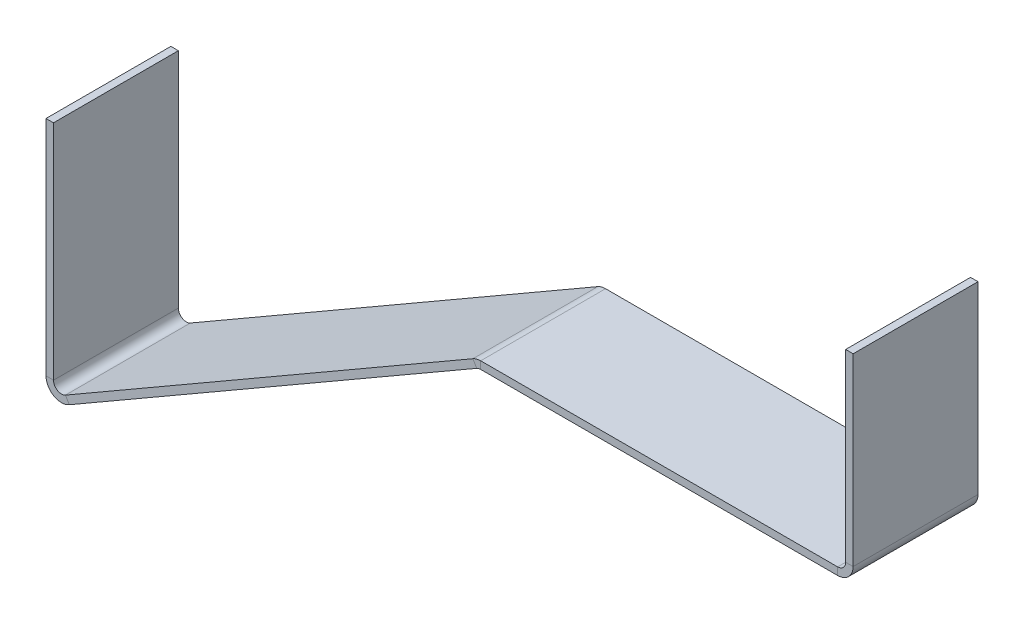
ISO-10303-21;
HEADER;
FILE_DESCRIPTION(('STEP AP214'),'2;1');
FILE_NAME('part.step','',(''),(''),'','','');
FILE_SCHEMA(('AUTOMOTIVE_DESIGN { 1 0 10303 214 1 1 1 1 }'));
ENDSEC;
DATA;
#1=APPLICATION_CONTEXT('core data for automotive mechanical design processes');
#2=APPLICATION_PROTOCOL_DEFINITION('international standard','automotive_design',2000,#1);
#3=PRODUCT_CONTEXT('',#1,'mechanical');
#4=PRODUCT('Part','Part','',(#3));
#5=PRODUCT_RELATED_PRODUCT_CATEGORY('part','',(#4));
#6=PRODUCT_DEFINITION_FORMATION('','',#4);
#7=PRODUCT_DEFINITION_CONTEXT('part definition',#1,'design');
#8=PRODUCT_DEFINITION('design','',#6,#7);
#9=PRODUCT_DEFINITION_SHAPE('','',#8);
#10=(LENGTH_UNIT() NAMED_UNIT(*) SI_UNIT(.MILLI.,.METRE.));
#11=(NAMED_UNIT(*) PLANE_ANGLE_UNIT() SI_UNIT($,.RADIAN.));
#12=(NAMED_UNIT(*) SI_UNIT($,.STERADIAN.) SOLID_ANGLE_UNIT());
#13=UNCERTAINTY_MEASURE_WITH_UNIT(LENGTH_MEASURE(1.E-05),#10,'distance_accuracy_value','');
#14=(GEOMETRIC_REPRESENTATION_CONTEXT(3) GLOBAL_UNCERTAINTY_ASSIGNED_CONTEXT((#13)) GLOBAL_UNIT_ASSIGNED_CONTEXT((#10,
#11,#12)) REPRESENTATION_CONTEXT('',''));
#15=CARTESIAN_POINT('',(0.,0.,0.));
#16=DIRECTION('',(0.,0.,1.));
#17=DIRECTION('',(1.,0.,0.));
#18=AXIS2_PLACEMENT_3D('',#15,#16,#17);
#19=CARTESIAN_POINT('',(-173.205080756888,-89.2612849930732,25.));
#20=DIRECTION('',(0.,0.,1.));
#21=DIRECTION('',(1.,0.,0.));
#22=AXIS2_PLACEMENT_3D('',#19,#20,#21);
#23=PLANE('',#22);
#24=DIRECTION('',(1.,0.,0.));
#25=VECTOR('',#24,1.);
#26=CARTESIAN_POINT('',(-173.205080756888,-89.2612849930732,25.));
#27=LINE('',#26,#25);
#28=CARTESIAN_POINT('',(-173.205080756888,-89.2612849930732,25.));
#29=VERTEX_POINT('',#28);
#30=CARTESIAN_POINT('',(-170.205080756888,-89.2612849930732,25.));
#31=VERTEX_POINT('',#30);
#32=EDGE_CURVE('E11',#29,#31,#27,.T.);
#33=ORIENTED_EDGE('',*,*,#32,.F.);
#34=CARTESIAN_POINT('',(-167.005080756888,-89.2612849930732,25.));
#35=DIRECTION('',(0.,0.,-1.));
#36=DIRECTION('',(-1.,0.,0.));
#37=AXIS2_PLACEMENT_3D('',#34,#35,#36);
#38=CIRCLE('',#37,6.2);
#39=CARTESIAN_POINT('',(-163.905080756888,-94.6306424965367,25.));
#40=VERTEX_POINT('',#39);
#41=EDGE_CURVE('E304',#29,#40,#38,.F.);
#42=ORIENTED_EDGE('',*,*,#41,.T.);
#43=DIRECTION('',(0.500000000000001,-0.866025403784438,0.));
#44=VECTOR('',#43,1.);
#45=CARTESIAN_POINT('',(-165.405080756888,-92.0325662851834,25.));
#46=LINE('',#45,#44);
#47=CARTESIAN_POINT('',(-165.405080756888,-92.0325662851834,25.));
#48=VERTEX_POINT('',#47);
#49=EDGE_CURVE('E45',#48,#40,#46,.T.);
#50=ORIENTED_EDGE('',*,*,#49,.F.);
#51=CARTESIAN_POINT('',(-167.005080756888,-89.2612849930732,25.));
#52=DIRECTION('',(0.,0.,1.));
#53=DIRECTION('',(1.,0.,0.));
#54=AXIS2_PLACEMENT_3D('',#51,#52,#53);
#55=CIRCLE('',#54,3.2);
#56=EDGE_CURVE('E323',#31,#48,#55,.T.);
#57=ORIENTED_EDGE('',*,*,#56,.F.);
#58=EDGE_LOOP('',(#33,#42,#50,#57));
#59=FACE_BOUND('',#58,.T.);
#60=ADVANCED_FACE('F37',(#59),#23,.T.);
#61=CARTESIAN_POINT('',(-165.405080756888,-92.0325662851834,25.));
#62=DIRECTION('',(0.,0.,1.));
#63=DIRECTION('',(1.,0.,0.));
#64=AXIS2_PLACEMENT_3D('',#61,#62,#63);
#65=PLANE('',#64);
#66=DIRECTION('',(0.,-1.,0.));
#67=VECTOR('',#66,1.);
#68=CARTESIAN_POINT('',(-173.205080756888,-2.77555756156289E-13,25.));
#69=LINE('',#68,#67);
#70=CARTESIAN_POINT('',(-173.205080756888,-2.77555756156289E-13,25.));
#71=VERTEX_POINT('',#70);
#72=EDGE_CURVE('E308',#71,#29,#69,.T.);
#73=ORIENTED_EDGE('',*,*,#72,.T.);
#74=ORIENTED_EDGE('',*,*,#32,.T.);
#75=DIRECTION('',(0.,1.,0.));
#76=VECTOR('',#75,1.);
#77=CARTESIAN_POINT('',(-170.205080756888,-2.77555756156289E-13,25.));
#78=LINE('',#77,#76);
#79=CARTESIAN_POINT('',(-170.205080756888,-2.77555756156289E-13,25.));
#80=VERTEX_POINT('',#79);
#81=EDGE_CURVE('E320',#80,#31,#78,.F.);
#82=ORIENTED_EDGE('',*,*,#81,.F.);
#83=DIRECTION('',(1.,0.,0.));
#84=VECTOR('',#83,1.);
#85=CARTESIAN_POINT('',(-173.205080756888,-2.77555756156289E-13,25.));
#86=LINE('',#85,#84);
#87=EDGE_CURVE('E317',#71,#80,#86,.T.);
#88=ORIENTED_EDGE('',*,*,#87,.F.);
#89=EDGE_LOOP('',(#73,#74,#82,#88));
#90=FACE_BOUND('',#89,.T.);
#91=ADVANCED_FACE('F373',(#90),#65,.T.);
#92=CARTESIAN_POINT('',(-163.905080756888,-94.6306424965367,-25.));
#93=DIRECTION('',(0.,0.,-1.));
#94=DIRECTION('',(-1.,0.,0.));
#95=AXIS2_PLACEMENT_3D('',#92,#93,#94);
#96=PLANE('',#95);
#97=DIRECTION('',(-0.500000000000001,0.866025403784438,0.));
#98=VECTOR('',#97,1.);
#99=CARTESIAN_POINT('',(-163.905080756888,-94.6306424965367,-25.));
#100=LINE('',#99,#98);
#101=CARTESIAN_POINT('',(-163.905080756888,-94.6306424965367,-25.));
#102=VERTEX_POINT('',#101);
#103=CARTESIAN_POINT('',(-165.405080756888,-92.0325662851834,-25.));
#104=VERTEX_POINT('',#103);
#105=EDGE_CURVE('E290',#102,#104,#100,.T.);
#106=ORIENTED_EDGE('',*,*,#105,.F.);
#107=CARTESIAN_POINT('',(-167.005080756888,-89.2612849930732,-25.));
#108=DIRECTION('',(0.,0.,-1.));
#109=DIRECTION('',(-1.,0.,0.));
#110=AXIS2_PLACEMENT_3D('',#107,#108,#109);
#111=CIRCLE('',#110,6.2);
#112=CARTESIAN_POINT('',(-173.205080756888,-89.2612849930732,-25.));
#113=VERTEX_POINT('',#112);
#114=EDGE_CURVE('E232',#113,#102,#111,.F.);
#115=ORIENTED_EDGE('',*,*,#114,.F.);
#116=DIRECTION('',(-1.,0.,0.));
#117=VECTOR('',#116,1.);
#118=CARTESIAN_POINT('',(-170.205080756888,-89.2612849930732,-25.));
#119=LINE('',#118,#117);
#120=CARTESIAN_POINT('',(-170.205080756888,-89.2612849930732,-25.));
#121=VERTEX_POINT('',#120);
#122=EDGE_CURVE('E288',#121,#113,#119,.T.);
#123=ORIENTED_EDGE('',*,*,#122,.F.);
#124=CARTESIAN_POINT('',(-167.005080756888,-89.2612849930732,-25.));
#125=DIRECTION('',(0.,0.,1.));
#126=DIRECTION('',(1.,0.,0.));
#127=AXIS2_PLACEMENT_3D('',#124,#125,#126);
#128=CIRCLE('',#127,3.2);
#129=EDGE_CURVE('E220',#121,#104,#128,.T.);
#130=ORIENTED_EDGE('',*,*,#129,.T.);
#131=EDGE_LOOP('',(#106,#115,#123,#130));
#132=FACE_BOUND('',#131,.T.);
#133=ADVANCED_FACE('F383',(#132),#96,.T.);
#134=CARTESIAN_POINT('',(-170.205080756888,-89.2612849930732,-25.));
#135=DIRECTION('',(0.,0.,-1.));
#136=DIRECTION('',(-1.,0.,0.));
#137=AXIS2_PLACEMENT_3D('',#134,#135,#136);
#138=PLANE('',#137);
#139=DIRECTION('',(0.866025403784438,0.500000000000001,0.));
#140=VECTOR('',#139,1.);
#141=CARTESIAN_POINT('',(-173.205080756888,-100.,-25.));
#142=LINE('',#141,#140);
#143=CARTESIAN_POINT('',(-0.742562584220147,-0.42871870788963,-25.));
#144=VERTEX_POINT('',#143);
#145=EDGE_CURVE('E235',#102,#144,#142,.T.);
#146=ORIENTED_EDGE('',*,*,#145,.F.);
#147=ORIENTED_EDGE('',*,*,#105,.T.);
#148=DIRECTION('',(0.866025403784438,0.500000000000001,0.));
#149=VECTOR('',#148,1.);
#150=CARTESIAN_POINT('',(-174.705080756888,-97.401923788647,-25.));
#151=LINE('',#150,#149);
#152=CARTESIAN_POINT('',(-2.24256258422004,2.16935750346367,-25.));
#153=VERTEX_POINT('',#152);
#154=EDGE_CURVE('E217',#104,#153,#151,.T.);
#155=ORIENTED_EDGE('',*,*,#154,.T.);
#156=DIRECTION('',(0.499999999999977,-0.866025403784452,0.));
#157=VECTOR('',#156,1.);
#158=CARTESIAN_POINT('',(-2.24256258422004,2.16935750346367,-25.));
#159=LINE('',#158,#157);
#160=EDGE_CURVE('E284',#153,#144,#159,.T.);
#161=ORIENTED_EDGE('',*,*,#160,.T.);
#162=EDGE_LOOP('',(#146,#147,#155,#161));
#163=FACE_BOUND('',#162,.T.);
#164=ADVANCED_FACE('F385',(#163),#138,.T.);
#165=CARTESIAN_POINT('',(-0.742562584220147,-0.42871870788963,25.));
#166=DIRECTION('',(0.,0.,1.));
#167=DIRECTION('',(1.,0.,0.));
#168=AXIS2_PLACEMENT_3D('',#165,#166,#167);
#169=PLANE('',#168);
#170=DIRECTION('',(-0.499999999999977,0.866025403784452,0.));
#171=VECTOR('',#170,1.);
#172=CARTESIAN_POINT('',(-0.742562584220147,-0.42871870788963,25.));
#173=LINE('',#172,#171);
#174=CARTESIAN_POINT('',(-0.742562584220147,-0.42871870788963,25.));
#175=VERTEX_POINT('',#174);
#176=CARTESIAN_POINT('',(-2.24256258422004,2.16935750346367,25.));
#177=VERTEX_POINT('',#176);
#178=EDGE_CURVE('E170',#175,#177,#173,.T.);
#179=ORIENTED_EDGE('',*,*,#178,.F.);
#180=CARTESIAN_POINT('',(0.857437415779813,-3.19999999999993,25.));
#181=DIRECTION('',(0.,0.,1.));
#182=DIRECTION('',(1.,0.,0.));
#183=AXIS2_PLACEMENT_3D('',#180,#181,#182);
#184=CIRCLE('',#183,3.2);
#185=CARTESIAN_POINT('',(0.857437415779813,0.,25.));
#186=VERTEX_POINT('',#185);
#187=EDGE_CURVE('E174',#175,#186,#184,.F.);
#188=ORIENTED_EDGE('',*,*,#187,.T.);
#189=DIRECTION('',(0.,-1.,0.));
#190=VECTOR('',#189,1.);
#191=CARTESIAN_POINT('',(0.857437415779813,3.,25.));
#192=LINE('',#191,#190);
#193=CARTESIAN_POINT('',(0.857437415779813,3.,25.));
#194=VERTEX_POINT('',#193);
#195=EDGE_CURVE('E158',#194,#186,#192,.T.);
#196=ORIENTED_EDGE('',*,*,#195,.F.);
#197=CARTESIAN_POINT('',(0.857437415779813,-3.19999999999993,25.));
#198=DIRECTION('',(0.,0.,1.));
#199=DIRECTION('',(1.,0.,0.));
#200=AXIS2_PLACEMENT_3D('',#197,#198,#199);
#201=CIRCLE('',#200,6.2);
#202=EDGE_CURVE('E326',#177,#194,#201,.F.);
#203=ORIENTED_EDGE('',*,*,#202,.F.);
#204=EDGE_LOOP('',(#179,#188,#196,#203));
#205=FACE_BOUND('',#204,.T.);
#206=ADVANCED_FACE('F176',(#205),#169,.T.);
#207=CARTESIAN_POINT('',(0.857437415779813,3.,25.));
#208=DIRECTION('',(0.,0.,1.));
#209=DIRECTION('',(1.,0.,0.));
#210=AXIS2_PLACEMENT_3D('',#207,#208,#209);
#211=PLANE('',#210);
#212=DIRECTION('',(0.866025403784438,0.500000000000001,0.));
#213=VECTOR('',#212,1.);
#214=CARTESIAN_POINT('',(-173.205080756888,-100.,25.));
#215=LINE('',#214,#213);
#216=EDGE_CURVE('E180',#40,#175,#215,.T.);
#217=ORIENTED_EDGE('',*,*,#216,.T.);
#218=ORIENTED_EDGE('',*,*,#178,.T.);
#219=DIRECTION('',(0.866025403784438,0.500000000000001,0.));
#220=VECTOR('',#219,1.);
#221=CARTESIAN_POINT('',(-174.705080756888,-97.401923788647,25.));
#222=LINE('',#221,#220);
#223=EDGE_CURVE('E298',#48,#177,#222,.T.);
#224=ORIENTED_EDGE('',*,*,#223,.F.);
#225=ORIENTED_EDGE('',*,*,#49,.T.);
#226=EDGE_LOOP('',(#217,#218,#224,#225));
#227=FACE_BOUND('',#226,.T.);
#228=ADVANCED_FACE('F294',(#227),#211,.T.);
#229=CARTESIAN_POINT('',(0.857437415779813,0.,-25.));
#230=DIRECTION('',(0.,0.,-1.));
#231=DIRECTION('',(-1.,0.,0.));
#232=AXIS2_PLACEMENT_3D('',#229,#230,#231);
#233=PLANE('',#232);
#234=DIRECTION('',(0.,1.,0.));
#235=VECTOR('',#234,1.);
#236=CARTESIAN_POINT('',(0.857437415779813,0.,-25.));
#237=LINE('',#236,#235);
#238=CARTESIAN_POINT('',(0.857437415779813,0.,-25.));
#239=VERTEX_POINT('',#238);
#240=CARTESIAN_POINT('',(0.857437415779813,3.,-25.));
#241=VERTEX_POINT('',#240);
#242=EDGE_CURVE('E171',#239,#241,#237,.T.);
#243=ORIENTED_EDGE('',*,*,#242,.F.);
#244=CARTESIAN_POINT('',(0.857437415779813,-3.19999999999993,-25.));
#245=DIRECTION('',(0.,0.,1.));
#246=DIRECTION('',(1.,0.,0.));
#247=AXIS2_PLACEMENT_3D('',#244,#245,#246);
#248=CIRCLE('',#247,3.2);
#249=EDGE_CURVE('E187',#144,#239,#248,.F.);
#250=ORIENTED_EDGE('',*,*,#249,.F.);
#251=ORIENTED_EDGE('',*,*,#160,.F.);
#252=CARTESIAN_POINT('',(0.857437415779813,-3.19999999999993,-25.));
#253=DIRECTION('',(0.,0.,1.));
#254=DIRECTION('',(1.,0.,0.));
#255=AXIS2_PLACEMENT_3D('',#252,#253,#254);
#256=CIRCLE('',#255,6.2);
#257=EDGE_CURVE('E214',#153,#241,#256,.F.);
#258=ORIENTED_EDGE('',*,*,#257,.T.);
#259=EDGE_LOOP('',(#243,#250,#251,#258));
#260=FACE_BOUND('',#259,.T.);
#261=ADVANCED_FACE('F387',(#260),#233,.T.);
#262=CARTESIAN_POINT('',(-2.24256258422004,2.16935750346367,-25.));
#263=DIRECTION('',(0.,0.,-1.));
#264=DIRECTION('',(-1.,0.,0.));
#265=AXIS2_PLACEMENT_3D('',#262,#263,#264);
#266=PLANE('',#265);
#267=DIRECTION('',(1.,0.,0.));
#268=VECTOR('',#267,1.);
#269=CARTESIAN_POINT('',(0.,0.,-25.));
#270=LINE('',#269,#268);
#271=CARTESIAN_POINT('',(143.8,0.,-25.));
#272=VERTEX_POINT('',#271);
#273=EDGE_CURVE('E239',#239,#272,#270,.T.);
#274=ORIENTED_EDGE('',*,*,#273,.F.);
#275=ORIENTED_EDGE('',*,*,#242,.T.);
#276=DIRECTION('',(1.,0.,0.));
#277=VECTOR('',#276,1.);
#278=CARTESIAN_POINT('',(0.,3.,-25.));
#279=LINE('',#278,#277);
#280=CARTESIAN_POINT('',(143.8,3.,-25.));
#281=VERTEX_POINT('',#280);
#282=EDGE_CURVE('E212',#241,#281,#279,.T.);
#283=ORIENTED_EDGE('',*,*,#282,.T.);
#284=DIRECTION('',(0.,-1.,0.));
#285=VECTOR('',#284,1.);
#286=CARTESIAN_POINT('',(143.8,3.,-25.));
#287=LINE('',#286,#285);
#288=EDGE_CURVE('E106',#281,#272,#287,.T.);
#289=ORIENTED_EDGE('',*,*,#288,.T.);
#290=EDGE_LOOP('',(#274,#275,#283,#289));
#291=FACE_BOUND('',#290,.T.);
#292=ADVANCED_FACE('F388',(#291),#266,.T.);
#293=CARTESIAN_POINT('',(143.8,0.,25.));
#294=DIRECTION('',(0.,0.,1.));
#295=DIRECTION('',(1.,0.,0.));
#296=AXIS2_PLACEMENT_3D('',#293,#294,#295);
#297=PLANE('',#296);
#298=DIRECTION('',(0.,1.,0.));
#299=VECTOR('',#298,1.);
#300=CARTESIAN_POINT('',(143.8,0.,25.));
#301=LINE('',#300,#299);
#302=CARTESIAN_POINT('',(143.8,0.,25.));
#303=VERTEX_POINT('',#302);
#304=CARTESIAN_POINT('',(143.8,3.,25.));
#305=VERTEX_POINT('',#304);
#306=EDGE_CURVE('E282',#303,#305,#301,.T.);
#307=ORIENTED_EDGE('',*,*,#306,.F.);
#308=CARTESIAN_POINT('',(143.8,6.2,25.));
#309=DIRECTION('',(0.,0.,-1.));
#310=DIRECTION('',(-1.,0.,0.));
#311=AXIS2_PLACEMENT_3D('',#308,#309,#310);
#312=CIRCLE('',#311,6.2);
#313=CARTESIAN_POINT('',(150.,6.2,25.));
#314=VERTEX_POINT('',#313);
#315=EDGE_CURVE('E195',#303,#314,#312,.F.);
#316=ORIENTED_EDGE('',*,*,#315,.T.);
#317=DIRECTION('',(1.,0.,0.));
#318=VECTOR('',#317,1.);
#319=CARTESIAN_POINT('',(147.,6.2,25.));
#320=LINE('',#319,#318);
#321=CARTESIAN_POINT('',(147.,6.2,25.));
#322=VERTEX_POINT('',#321);
#323=EDGE_CURVE('E53',#322,#314,#320,.T.);
#324=ORIENTED_EDGE('',*,*,#323,.F.);
#325=CARTESIAN_POINT('',(143.8,6.2,25.));
#326=DIRECTION('',(0.,0.,1.));
#327=DIRECTION('',(1.,0.,0.));
#328=AXIS2_PLACEMENT_3D('',#325,#326,#327);
#329=CIRCLE('',#328,3.2);
#330=EDGE_CURVE('E329',#305,#322,#329,.T.);
#331=ORIENTED_EDGE('',*,*,#330,.F.);
#332=EDGE_LOOP('',(#307,#316,#324,#331));
#333=FACE_BOUND('',#332,.T.);
#334=ADVANCED_FACE('F352',(#333),#297,.T.);
#335=CARTESIAN_POINT('',(147.,6.2,25.));
#336=DIRECTION('',(0.,0.,1.));
#337=DIRECTION('',(1.,0.,0.));
#338=AXIS2_PLACEMENT_3D('',#335,#336,#337);
#339=PLANE('',#338);
#340=DIRECTION('',(1.,0.,0.));
#341=VECTOR('',#340,1.);
#342=CARTESIAN_POINT('',(0.,0.,25.));
#343=LINE('',#342,#341);
#344=EDGE_CURVE('E162',#186,#303,#343,.T.);
#345=ORIENTED_EDGE('',*,*,#344,.T.);
#346=ORIENTED_EDGE('',*,*,#306,.T.);
#347=DIRECTION('',(1.,0.,0.));
#348=VECTOR('',#347,1.);
#349=CARTESIAN_POINT('',(0.,3.,25.));
#350=LINE('',#349,#348);
#351=EDGE_CURVE('E165',#194,#305,#350,.T.);
#352=ORIENTED_EDGE('',*,*,#351,.F.);
#353=ORIENTED_EDGE('',*,*,#195,.T.);
#354=EDGE_LOOP('',(#345,#346,#352,#353));
#355=FACE_BOUND('',#354,.T.);
#356=ADVANCED_FACE('F160',(#355),#339,.T.);
#357=CARTESIAN_POINT('',(150.,6.2,-25.));
#358=DIRECTION('',(0.,0.,-1.));
#359=DIRECTION('',(-1.,0.,0.));
#360=AXIS2_PLACEMENT_3D('',#357,#358,#359);
#361=PLANE('',#360);
#362=DIRECTION('',(-1.,0.,0.));
#363=VECTOR('',#362,1.);
#364=CARTESIAN_POINT('',(150.,6.2,-25.));
#365=LINE('',#364,#363);
#366=CARTESIAN_POINT('',(150.,6.2,-25.));
#367=VERTEX_POINT('',#366);
#368=CARTESIAN_POINT('',(147.,6.2,-25.));
#369=VERTEX_POINT('',#368);
#370=EDGE_CURVE('E113',#367,#369,#365,.T.);
#371=ORIENTED_EDGE('',*,*,#370,.F.);
#372=CARTESIAN_POINT('',(143.8,6.2,-25.));
#373=DIRECTION('',(0.,0.,-1.));
#374=DIRECTION('',(-1.,0.,0.));
#375=AXIS2_PLACEMENT_3D('',#372,#373,#374);
#376=CIRCLE('',#375,6.2);
#377=EDGE_CURVE('E241',#272,#367,#376,.F.);
#378=ORIENTED_EDGE('',*,*,#377,.F.);
#379=ORIENTED_EDGE('',*,*,#288,.F.);
#380=CARTESIAN_POINT('',(143.8,6.2,-25.));
#381=DIRECTION('',(0.,0.,1.));
#382=DIRECTION('',(1.,0.,0.));
#383=AXIS2_PLACEMENT_3D('',#380,#381,#382);
#384=CIRCLE('',#383,3.2);
#385=EDGE_CURVE('E210',#281,#369,#384,.T.);
#386=ORIENTED_EDGE('',*,*,#385,.T.);
#387=EDGE_LOOP('',(#371,#378,#379,#386));
#388=FACE_BOUND('',#387,.T.);
#389=ADVANCED_FACE('F392',(#388),#361,.T.);
#390=CARTESIAN_POINT('',(143.8,3.,-25.));
#391=DIRECTION('',(0.,0.,-1.));
#392=DIRECTION('',(-1.,0.,0.));
#393=AXIS2_PLACEMENT_3D('',#390,#391,#392);
#394=PLANE('',#393);
#395=DIRECTION('',(0.,1.,0.));
#396=VECTOR('',#395,1.);
#397=CARTESIAN_POINT('',(150.,0.,-25.));
#398=LINE('',#397,#396);
#399=CARTESIAN_POINT('',(150.,80.,-25.));
#400=VERTEX_POINT('',#399);
#401=EDGE_CURVE('E201',#367,#400,#398,.T.);
#402=ORIENTED_EDGE('',*,*,#401,.F.);
#403=ORIENTED_EDGE('',*,*,#370,.T.);
#404=DIRECTION('',(0.,1.,0.));
#405=VECTOR('',#404,1.);
#406=CARTESIAN_POINT('',(147.,0.,-25.));
#407=LINE('',#406,#405);
#408=CARTESIAN_POINT('',(147.,80.,-25.));
#409=VERTEX_POINT('',#408);
#410=EDGE_CURVE('E207',#369,#409,#407,.T.);
#411=ORIENTED_EDGE('',*,*,#410,.T.);
#412=DIRECTION('',(1.,0.,0.));
#413=VECTOR('',#412,1.);
#414=CARTESIAN_POINT('',(147.,80.,-25.));
#415=LINE('',#414,#413);
#416=EDGE_CURVE('E204',#409,#400,#415,.T.);
#417=ORIENTED_EDGE('',*,*,#416,.T.);
#418=EDGE_LOOP('',(#402,#403,#411,#417));
#419=FACE_BOUND('',#418,.T.);
#420=ADVANCED_FACE('F394',(#419),#394,.T.);
#421=CARTESIAN_POINT('',(150.,0.,25.));
#422=DIRECTION('',(-1.,0.,0.));
#423=DIRECTION('',(0.,0.,1.));
#424=AXIS2_PLACEMENT_3D('',#421,#422,#423);
#425=PLANE('',#424);
#426=ORIENTED_EDGE('',*,*,#401,.T.);
#427=DIRECTION('',(0.,0.,-1.));
#428=VECTOR('',#427,1.);
#429=CARTESIAN_POINT('',(150.,80.,25.));
#430=LINE('',#429,#428);
#431=CARTESIAN_POINT('',(150.,80.,25.));
#432=VERTEX_POINT('',#431);
#433=EDGE_CURVE('E277',#432,#400,#430,.T.);
#434=ORIENTED_EDGE('',*,*,#433,.F.);
#435=DIRECTION('',(0.,1.,0.));
#436=VECTOR('',#435,1.);
#437=CARTESIAN_POINT('',(150.,0.,25.));
#438=LINE('',#437,#436);
#439=EDGE_CURVE('E119',#314,#432,#438,.T.);
#440=ORIENTED_EDGE('',*,*,#439,.F.);
#441=DIRECTION('',(0.,0.,-1.));
#442=VECTOR('',#441,1.);
#443=CARTESIAN_POINT('',(150.,6.2,25.));
#444=LINE('',#443,#442);
#445=EDGE_CURVE('E197',#314,#367,#444,.T.);
#446=ORIENTED_EDGE('',*,*,#445,.T.);
#447=EDGE_LOOP('',(#426,#434,#440,#446));
#448=FACE_BOUND('',#447,.T.);
#449=ADVANCED_FACE('F400',(#448),#425,.F.);
#450=CARTESIAN_POINT('',(147.,80.,25.));
#451=DIRECTION('',(0.,1.,0.));
#452=DIRECTION('',(0.,0.,1.));
#453=AXIS2_PLACEMENT_3D('',#450,#451,#452);
#454=PLANE('',#453);
#455=ORIENTED_EDGE('',*,*,#416,.F.);
#456=DIRECTION('',(0.,0.,-1.));
#457=VECTOR('',#456,1.);
#458=CARTESIAN_POINT('',(147.,80.,25.));
#459=LINE('',#458,#457);
#460=CARTESIAN_POINT('',(147.,80.,25.));
#461=VERTEX_POINT('',#460);
#462=EDGE_CURVE('E275',#461,#409,#459,.T.);
#463=ORIENTED_EDGE('',*,*,#462,.F.);
#464=DIRECTION('',(1.,0.,0.));
#465=VECTOR('',#464,1.);
#466=CARTESIAN_POINT('',(147.,80.,25.));
#467=LINE('',#466,#465);
#468=EDGE_CURVE('E335',#461,#432,#467,.T.);
#469=ORIENTED_EDGE('',*,*,#468,.T.);
#470=ORIENTED_EDGE('',*,*,#433,.T.);
#471=EDGE_LOOP('',(#455,#463,#469,#470));
#472=FACE_BOUND('',#471,.T.);
#473=ADVANCED_FACE('F340',(#472),#454,.T.);
#474=CARTESIAN_POINT('',(147.,0.,25.));
#475=DIRECTION('',(-1.,0.,0.));
#476=DIRECTION('',(0.,0.,1.));
#477=AXIS2_PLACEMENT_3D('',#474,#475,#476);
#478=PLANE('',#477);
#479=ORIENTED_EDGE('',*,*,#410,.F.);
#480=DIRECTION('',(0.,0.,-1.));
#481=VECTOR('',#480,1.);
#482=CARTESIAN_POINT('',(147.,6.2,25.));
#483=LINE('',#482,#481);
#484=EDGE_CURVE('E272',#322,#369,#483,.T.);
#485=ORIENTED_EDGE('',*,*,#484,.F.);
#486=DIRECTION('',(0.,1.,0.));
#487=VECTOR('',#486,1.);
#488=CARTESIAN_POINT('',(147.,0.,25.));
#489=LINE('',#488,#487);
#490=EDGE_CURVE('E332',#322,#461,#489,.T.);
#491=ORIENTED_EDGE('',*,*,#490,.T.);
#492=ORIENTED_EDGE('',*,*,#462,.T.);
#493=EDGE_LOOP('',(#479,#485,#491,#492));
#494=FACE_BOUND('',#493,.T.);
#495=ADVANCED_FACE('F345',(#494),#478,.T.);
#496=CARTESIAN_POINT('',(143.8,6.2,25.));
#497=DIRECTION('',(0.,0.,-1.));
#498=DIRECTION('',(-1.,0.,0.));
#499=AXIS2_PLACEMENT_3D('',#496,#497,#498);
#500=CYLINDRICAL_SURFACE('',#499,3.2);
#501=ORIENTED_EDGE('',*,*,#385,.F.);
#502=DIRECTION('',(0.,0.,-1.));
#503=VECTOR('',#502,1.);
#504=CARTESIAN_POINT('',(143.8,3.,25.));
#505=LINE('',#504,#503);
#506=EDGE_CURVE('E269',#305,#281,#505,.T.);
#507=ORIENTED_EDGE('',*,*,#506,.F.);
#508=ORIENTED_EDGE('',*,*,#330,.T.);
#509=ORIENTED_EDGE('',*,*,#484,.T.);
#510=EDGE_LOOP('',(#501,#507,#508,#509));
#511=FACE_BOUND('',#510,.T.);
#512=ADVANCED_FACE('F348',(#511),#500,.F.);
#513=CARTESIAN_POINT('',(0.,3.,25.));
#514=DIRECTION('',(0.,1.,0.));
#515=DIRECTION('',(0.,0.,1.));
#516=AXIS2_PLACEMENT_3D('',#513,#514,#515);
#517=PLANE('',#516);
#518=ORIENTED_EDGE('',*,*,#282,.F.);
#519=DIRECTION('',(0.,0.,-1.));
#520=VECTOR('',#519,1.);
#521=CARTESIAN_POINT('',(0.857437415779813,3.,25.));
#522=LINE('',#521,#520);
#523=EDGE_CURVE('E266',#194,#241,#522,.T.);
#524=ORIENTED_EDGE('',*,*,#523,.F.);
#525=ORIENTED_EDGE('',*,*,#351,.T.);
#526=ORIENTED_EDGE('',*,*,#506,.T.);
#527=EDGE_LOOP('',(#518,#524,#525,#526));
#528=FACE_BOUND('',#527,.T.);
#529=ADVANCED_FACE('F355',(#528),#517,.T.);
#530=CARTESIAN_POINT('',(0.857437415779813,-3.19999999999993,25.));
#531=DIRECTION('',(0.,0.,-1.));
#532=DIRECTION('',(-1.,0.,0.));
#533=AXIS2_PLACEMENT_3D('',#530,#531,#532);
#534=CYLINDRICAL_SURFACE('',#533,6.2);
#535=ORIENTED_EDGE('',*,*,#257,.F.);
#536=DIRECTION('',(0.,0.,-1.));
#537=VECTOR('',#536,1.);
#538=CARTESIAN_POINT('',(-2.24256258422004,2.16935750346367,25.));
#539=LINE('',#538,#537);
#540=EDGE_CURVE('E263',#177,#153,#539,.T.);
#541=ORIENTED_EDGE('',*,*,#540,.F.);
#542=ORIENTED_EDGE('',*,*,#202,.T.);
#543=ORIENTED_EDGE('',*,*,#523,.T.);
#544=EDGE_LOOP('',(#535,#541,#542,#543));
#545=FACE_BOUND('',#544,.T.);
#546=ADVANCED_FACE('F358',(#545),#534,.T.);
#547=CARTESIAN_POINT('',(-174.705080756888,-97.401923788647,25.));
#548=DIRECTION('',(-0.500000000000001,0.866025403784438,0.));
#549=DIRECTION('',(-0.866025403784438,-0.500000000000001,0.));
#550=AXIS2_PLACEMENT_3D('',#547,#548,#549);
#551=PLANE('',#550);
#552=ORIENTED_EDGE('',*,*,#154,.F.);
#553=DIRECTION('',(0.,0.,-1.));
#554=VECTOR('',#553,1.);
#555=CARTESIAN_POINT('',(-165.405080756888,-92.0325662851834,25.));
#556=LINE('',#555,#554);
#557=EDGE_CURVE('E260',#48,#104,#556,.T.);
#558=ORIENTED_EDGE('',*,*,#557,.F.);
#559=ORIENTED_EDGE('',*,*,#223,.T.);
#560=ORIENTED_EDGE('',*,*,#540,.T.);
#561=EDGE_LOOP('',(#552,#558,#559,#560));
#562=FACE_BOUND('',#561,.T.);
#563=ADVANCED_FACE('F362',(#562),#551,.T.);
#564=CARTESIAN_POINT('',(-167.005080756888,-89.2612849930732,25.));
#565=DIRECTION('',(0.,0.,-1.));
#566=DIRECTION('',(-1.,0.,0.));
#567=AXIS2_PLACEMENT_3D('',#564,#565,#566);
#568=CYLINDRICAL_SURFACE('',#567,3.2);
#569=ORIENTED_EDGE('',*,*,#129,.F.);
#570=DIRECTION('',(0.,0.,-1.));
#571=VECTOR('',#570,1.);
#572=CARTESIAN_POINT('',(-170.205080756888,-89.2612849930732,25.));
#573=LINE('',#572,#571);
#574=EDGE_CURVE('E257',#31,#121,#573,.T.);
#575=ORIENTED_EDGE('',*,*,#574,.F.);
#576=ORIENTED_EDGE('',*,*,#56,.T.);
#577=ORIENTED_EDGE('',*,*,#557,.T.);
#578=EDGE_LOOP('',(#569,#575,#576,#577));
#579=FACE_BOUND('',#578,.T.);
#580=ADVANCED_FACE('F365',(#579),#568,.F.);
#581=CARTESIAN_POINT('',(-170.205080756888,-2.77555756156289E-13,25.));
#582=DIRECTION('',(1.,0.,0.));
#583=DIRECTION('',(0.,0.,-1.));
#584=AXIS2_PLACEMENT_3D('',#581,#582,#583);
#585=PLANE('',#584);
#586=DIRECTION('',(0.,1.,0.));
#587=VECTOR('',#586,1.);
#588=CARTESIAN_POINT('',(-170.205080756888,-2.77555756156289E-13,-25.));
#589=LINE('',#588,#587);
#590=CARTESIAN_POINT('',(-170.205080756888,-2.77555756156289E-13,-25.));
#591=VERTEX_POINT('',#590);
#592=EDGE_CURVE('E223',#591,#121,#589,.F.);
#593=ORIENTED_EDGE('',*,*,#592,.F.);
#594=DIRECTION('',(0.,0.,-1.));
#595=VECTOR('',#594,1.);
#596=CARTESIAN_POINT('',(-170.205080756888,-2.77555756156289E-13,25.));
#597=LINE('',#596,#595);
#598=EDGE_CURVE('E255',#80,#591,#597,.T.);
#599=ORIENTED_EDGE('',*,*,#598,.F.);
#600=ORIENTED_EDGE('',*,*,#81,.T.);
#601=ORIENTED_EDGE('',*,*,#574,.T.);
#602=EDGE_LOOP('',(#593,#599,#600,#601));
#603=FACE_BOUND('',#602,.T.);
#604=ADVANCED_FACE('F370',(#603),#585,.T.);
#605=CARTESIAN_POINT('',(-173.205080756888,-2.77555756156289E-13,25.));
#606=DIRECTION('',(0.,1.,0.));
#607=DIRECTION('',(0.,0.,1.));
#608=AXIS2_PLACEMENT_3D('',#605,#606,#607);
#609=PLANE('',#608);
#610=DIRECTION('',(1.,0.,0.));
#611=VECTOR('',#610,1.);
#612=CARTESIAN_POINT('',(-173.205080756888,-2.77555756156289E-13,-25.));
#613=LINE('',#612,#611);
#614=CARTESIAN_POINT('',(-173.205080756888,-2.77555756156289E-13,-25.));
#615=VERTEX_POINT('',#614);
#616=EDGE_CURVE('E226',#615,#591,#613,.T.);
#617=ORIENTED_EDGE('',*,*,#616,.F.);
#618=DIRECTION('',(0.,0.,-1.));
#619=VECTOR('',#618,1.);
#620=CARTESIAN_POINT('',(-173.205080756888,-2.77555756156289E-13,25.));
#621=LINE('',#620,#619);
#622=EDGE_CURVE('E253',#71,#615,#621,.T.);
#623=ORIENTED_EDGE('',*,*,#622,.F.);
#624=ORIENTED_EDGE('',*,*,#87,.T.);
#625=ORIENTED_EDGE('',*,*,#598,.T.);
#626=EDGE_LOOP('',(#617,#623,#624,#625));
#627=FACE_BOUND('',#626,.T.);
#628=ADVANCED_FACE('F376',(#627),#609,.T.);
#629=CARTESIAN_POINT('',(-173.205080756888,-2.77555756156289E-13,25.));
#630=DIRECTION('',(1.,0.,0.));
#631=DIRECTION('',(0.,0.,-1.));
#632=AXIS2_PLACEMENT_3D('',#629,#630,#631);
#633=PLANE('',#632);
#634=DIRECTION('',(0.,-1.,0.));
#635=VECTOR('',#634,1.);
#636=CARTESIAN_POINT('',(-173.205080756888,-2.77555756156289E-13,-25.));
#637=LINE('',#636,#635);
#638=EDGE_CURVE('E229',#615,#113,#637,.T.);
#639=ORIENTED_EDGE('',*,*,#638,.T.);
#640=DIRECTION('',(0.,0.,-1.));
#641=VECTOR('',#640,1.);
#642=CARTESIAN_POINT('',(-173.205080756888,-89.2612849930732,25.));
#643=LINE('',#642,#641);
#644=EDGE_CURVE('E250',#29,#113,#643,.T.);
#645=ORIENTED_EDGE('',*,*,#644,.F.);
#646=ORIENTED_EDGE('',*,*,#72,.F.);
#647=ORIENTED_EDGE('',*,*,#622,.T.);
#648=EDGE_LOOP('',(#639,#645,#646,#647));
#649=FACE_BOUND('',#648,.T.);
#650=ADVANCED_FACE('F381',(#649),#633,.F.);
#651=CARTESIAN_POINT('',(-167.005080756888,-89.2612849930732,25.));
#652=DIRECTION('',(0.,0.,-1.));
#653=DIRECTION('',(-1.,0.,0.));
#654=AXIS2_PLACEMENT_3D('',#651,#652,#653);
#655=CYLINDRICAL_SURFACE('',#654,6.2);
#656=ORIENTED_EDGE('',*,*,#114,.T.);
#657=DIRECTION('',(0.,0.,-1.));
#658=VECTOR('',#657,1.);
#659=CARTESIAN_POINT('',(-163.905080756888,-94.6306424965367,25.));
#660=LINE('',#659,#658);
#661=EDGE_CURVE('E247',#40,#102,#660,.T.);
#662=ORIENTED_EDGE('',*,*,#661,.F.);
#663=ORIENTED_EDGE('',*,*,#41,.F.);
#664=ORIENTED_EDGE('',*,*,#644,.T.);
#665=EDGE_LOOP('',(#656,#662,#663,#664));
#666=FACE_BOUND('',#665,.T.);
#667=ADVANCED_FACE('F310',(#666),#655,.T.);
#668=CARTESIAN_POINT('',(-173.205080756888,-100.,25.));
#669=DIRECTION('',(-0.500000000000001,0.866025403784438,0.));
#670=DIRECTION('',(-0.866025403784438,-0.500000000000001,0.));
#671=AXIS2_PLACEMENT_3D('',#668,#669,#670);
#672=PLANE('',#671);
#673=ORIENTED_EDGE('',*,*,#145,.T.);
#674=DIRECTION('',(0.,0.,-1.));
#675=VECTOR('',#674,1.);
#676=CARTESIAN_POINT('',(-0.742562584220147,-0.42871870788963,25.));
#677=LINE('',#676,#675);
#678=EDGE_CURVE('E189',#175,#144,#677,.T.);
#679=ORIENTED_EDGE('',*,*,#678,.F.);
#680=ORIENTED_EDGE('',*,*,#216,.F.);
#681=ORIENTED_EDGE('',*,*,#661,.T.);
#682=EDGE_LOOP('',(#673,#679,#680,#681));
#683=FACE_BOUND('',#682,.T.);
#684=ADVANCED_FACE('F314',(#683),#672,.F.);
#685=CARTESIAN_POINT('',(0.857437415779813,-3.19999999999993,25.));
#686=DIRECTION('',(0.,0.,-1.));
#687=DIRECTION('',(-1.,0.,0.));
#688=AXIS2_PLACEMENT_3D('',#685,#686,#687);
#689=CYLINDRICAL_SURFACE('',#688,3.2);
#690=ORIENTED_EDGE('',*,*,#249,.T.);
#691=DIRECTION('',(0.,0.,-1.));
#692=VECTOR('',#691,1.);
#693=CARTESIAN_POINT('',(0.857437415779813,0.,25.));
#694=LINE('',#693,#692);
#695=EDGE_CURVE('E184',#186,#239,#694,.T.);
#696=ORIENTED_EDGE('',*,*,#695,.F.);
#697=ORIENTED_EDGE('',*,*,#187,.F.);
#698=ORIENTED_EDGE('',*,*,#678,.T.);
#699=EDGE_LOOP('',(#690,#696,#697,#698));
#700=FACE_BOUND('',#699,.T.);
#701=ADVANCED_FACE('F185',(#700),#689,.F.);
#702=CARTESIAN_POINT('',(0.,0.,25.));
#703=DIRECTION('',(0.,1.,0.));
#704=DIRECTION('',(0.,0.,1.));
#705=AXIS2_PLACEMENT_3D('',#702,#703,#704);
#706=PLANE('',#705);
#707=ORIENTED_EDGE('',*,*,#273,.T.);
#708=DIRECTION('',(0.,0.,-1.));
#709=VECTOR('',#708,1.);
#710=CARTESIAN_POINT('',(143.8,0.,25.));
#711=LINE('',#710,#709);
#712=EDGE_CURVE('E190',#303,#272,#711,.T.);
#713=ORIENTED_EDGE('',*,*,#712,.F.);
#714=ORIENTED_EDGE('',*,*,#344,.F.);
#715=ORIENTED_EDGE('',*,*,#695,.T.);
#716=EDGE_LOOP('',(#707,#713,#714,#715));
#717=FACE_BOUND('',#716,.T.);
#718=ADVANCED_FACE('F192',(#717),#706,.F.);
#719=CARTESIAN_POINT('',(143.8,6.2,25.));
#720=DIRECTION('',(0.,0.,-1.));
#721=DIRECTION('',(-1.,0.,0.));
#722=AXIS2_PLACEMENT_3D('',#719,#720,#721);
#723=CYLINDRICAL_SURFACE('',#722,6.2);
#724=ORIENTED_EDGE('',*,*,#377,.T.);
#725=ORIENTED_EDGE('',*,*,#445,.F.);
#726=ORIENTED_EDGE('',*,*,#315,.F.);
#727=ORIENTED_EDGE('',*,*,#712,.T.);
#728=EDGE_LOOP('',(#724,#725,#726,#727));
#729=FACE_BOUND('',#728,.T.);
#730=ADVANCED_FACE('F390',(#729),#723,.T.);
#731=CARTESIAN_POINT('',(143.8,6.2,25.));
#732=DIRECTION('',(0.,0.,1.));
#733=DIRECTION('',(1.,0.,0.));
#734=AXIS2_PLACEMENT_3D('',#731,#732,#733);
#735=PLANE('',#734);
#736=ORIENTED_EDGE('',*,*,#439,.T.);
#737=ORIENTED_EDGE('',*,*,#468,.F.);
#738=ORIENTED_EDGE('',*,*,#490,.F.);
#739=ORIENTED_EDGE('',*,*,#323,.T.);
#740=EDGE_LOOP('',(#736,#737,#738,#739));
#741=FACE_BOUND('',#740,.T.);
#742=ADVANCED_FACE('F341',(#741),#735,.T.);
#743=CARTESIAN_POINT('',(143.8,6.2,-25.));
#744=DIRECTION('',(0.,0.,1.));
#745=DIRECTION('',(1.,0.,0.));
#746=AXIS2_PLACEMENT_3D('',#743,#744,#745);
#747=PLANE('',#746);
#748=ORIENTED_EDGE('',*,*,#592,.T.);
#749=ORIENTED_EDGE('',*,*,#122,.T.);
#750=ORIENTED_EDGE('',*,*,#638,.F.);
#751=ORIENTED_EDGE('',*,*,#616,.T.);
#752=EDGE_LOOP('',(#748,#749,#750,#751));
#753=FACE_BOUND('',#752,.T.);
#754=ADVANCED_FACE('F599',(#753),#747,.F.);
#755=CLOSED_SHELL('',(#60,#91,#133,#164,#206,#228,#261,#292,#334,#356,#389,#420,#449,#473,#495,
#512,#529,#546,#563,#580,#604,#628,#650,#667,#684,#701,#718,#730,#742,#754));
#756=MANIFOLD_SOLID_BREP('B2',#755);
#757=ADVANCED_BREP_SHAPE_REPRESENTATION('',(#18,#756),#14);
#758=SHAPE_DEFINITION_REPRESENTATION(#9,#757);
ENDSEC;
END-ISO-10303-21;
